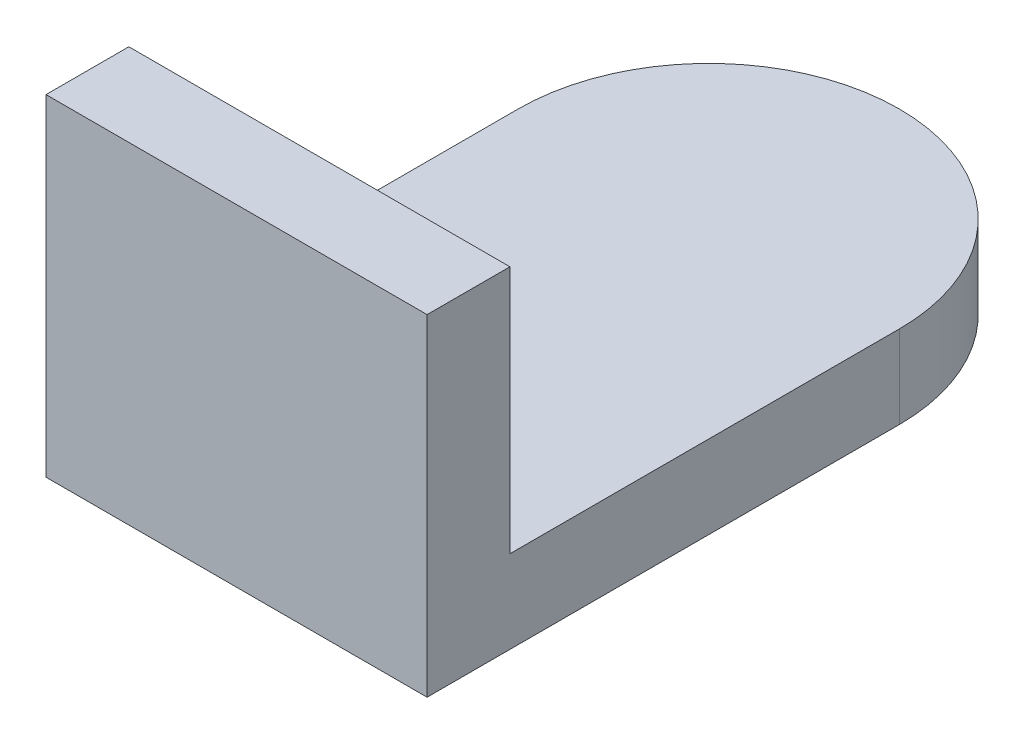
ISO-10303-21;
HEADER;
FILE_DESCRIPTION(('STEP AP214'),'2;1');
FILE_NAME('part.step','',(''),(''),'','','');
FILE_SCHEMA(('AUTOMOTIVE_DESIGN { 1 0 10303 214 1 1 1 1 }'));
ENDSEC;
DATA;
#1=APPLICATION_CONTEXT('core data for automotive mechanical design processes');
#2=APPLICATION_PROTOCOL_DEFINITION('international standard','automotive_design',2000,#1);
#3=PRODUCT_CONTEXT('',#1,'mechanical');
#4=PRODUCT('Part','Part','',(#3));
#5=PRODUCT_RELATED_PRODUCT_CATEGORY('part','',(#4));
#6=PRODUCT_DEFINITION_FORMATION('','',#4);
#7=PRODUCT_DEFINITION_CONTEXT('part definition',#1,'design');
#8=PRODUCT_DEFINITION('design','',#6,#7);
#9=PRODUCT_DEFINITION_SHAPE('','',#8);
#10=(LENGTH_UNIT() NAMED_UNIT(*) SI_UNIT(.MILLI.,.METRE.));
#11=(NAMED_UNIT(*) PLANE_ANGLE_UNIT() SI_UNIT($,.RADIAN.));
#12=(NAMED_UNIT(*) SI_UNIT($,.STERADIAN.) SOLID_ANGLE_UNIT());
#13=UNCERTAINTY_MEASURE_WITH_UNIT(LENGTH_MEASURE(1.E-05),#10,'distance_accuracy_value','');
#14=(GEOMETRIC_REPRESENTATION_CONTEXT(3) GLOBAL_UNCERTAINTY_ASSIGNED_CONTEXT((#13)) GLOBAL_UNIT_ASSIGNED_CONTEXT((#10,
#11,#12)) REPRESENTATION_CONTEXT('',''));
#15=CARTESIAN_POINT('',(0.,0.,0.));
#16=DIRECTION('',(0.,0.,1.));
#17=DIRECTION('',(1.,0.,0.));
#18=AXIS2_PLACEMENT_3D('',#15,#16,#17);
#19=CARTESIAN_POINT('',(0.,0.,1.45));
#20=DIRECTION('',(0.,0.,-1.));
#21=DIRECTION('',(-1.,0.,0.));
#22=AXIS2_PLACEMENT_3D('',#19,#20,#21);
#23=PLANE('',#22);
#24=DIRECTION('',(0.,1.,0.));
#25=VECTOR('',#24,1.);
#26=CARTESIAN_POINT('',(0.365,-0.2,1.45));
#27=LINE('',#26,#25);
#28=CARTESIAN_POINT('',(0.365,-0.35,1.45));
#29=VERTEX_POINT('',#28);
#30=CARTESIAN_POINT('',(0.365,-0.2,1.45));
#31=VERTEX_POINT('',#30);
#32=EDGE_CURVE('E11',#29,#31,#27,.T.);
#33=ORIENTED_EDGE('',*,*,#32,.F.);
#34=DIRECTION('',(-1.,0.,0.));
#35=VECTOR('',#34,1.);
#36=CARTESIAN_POINT('',(0.135,-0.35,1.45));
#37=LINE('',#36,#35);
#38=CARTESIAN_POINT('',(0.135,-0.35,1.45));
#39=VERTEX_POINT('',#38);
#40=EDGE_CURVE('E24',#29,#39,#37,.T.);
#41=ORIENTED_EDGE('',*,*,#40,.T.);
#42=DIRECTION('',(0.,-1.,0.));
#43=VECTOR('',#42,1.);
#44=CARTESIAN_POINT('',(0.135,-0.2,1.45));
#45=LINE('',#44,#43);
#46=CARTESIAN_POINT('',(0.135,-0.2,1.45));
#47=VERTEX_POINT('',#46);
#48=EDGE_CURVE('E74',#47,#39,#45,.T.);
#49=ORIENTED_EDGE('',*,*,#48,.F.);
#50=DIRECTION('',(-1.,0.,0.));
#51=VECTOR('',#50,1.);
#52=CARTESIAN_POINT('',(0.135,-0.2,1.45));
#53=LINE('',#52,#51);
#54=EDGE_CURVE('E117',#31,#47,#53,.T.);
#55=ORIENTED_EDGE('',*,*,#54,.F.);
#56=EDGE_LOOP('',(#33,#41,#49,#55));
#57=FACE_BOUND('',#56,.T.);
#58=ADVANCED_FACE('F17',(#57),#23,.T.);
#59=CARTESIAN_POINT('',(0.135,-0.2,1.45));
#60=DIRECTION('',(0.,1.,0.));
#61=DIRECTION('',(-1.,0.,0.));
#62=AXIS2_PLACEMENT_3D('',#59,#60,#61);
#63=PLANE('',#62);
#64=DIRECTION('',(-1.,0.,0.));
#65=VECTOR('',#64,1.);
#66=CARTESIAN_POINT('',(0.135,-0.2,1.5));
#67=LINE('',#66,#65);
#68=CARTESIAN_POINT('',(0.365,-0.2,1.5));
#69=VERTEX_POINT('',#68);
#70=CARTESIAN_POINT('',(0.135,-0.2,1.5));
#71=VERTEX_POINT('',#70);
#72=EDGE_CURVE('E115',#69,#71,#67,.T.);
#73=ORIENTED_EDGE('',*,*,#72,.F.);
#74=DIRECTION('',(0.,0.,1.));
#75=VECTOR('',#74,1.);
#76=CARTESIAN_POINT('',(0.365,-0.2,1.45));
#77=LINE('',#76,#75);
#78=EDGE_CURVE('E113',#31,#69,#77,.T.);
#79=ORIENTED_EDGE('',*,*,#78,.F.);
#80=ORIENTED_EDGE('',*,*,#54,.T.);
#81=DIRECTION('',(0.,0.,1.));
#82=VECTOR('',#81,1.);
#83=CARTESIAN_POINT('',(0.135,-0.2,1.45));
#84=LINE('',#83,#82);
#85=EDGE_CURVE('E110',#47,#71,#84,.T.);
#86=ORIENTED_EDGE('',*,*,#85,.T.);
#87=EDGE_LOOP('',(#73,#79,#80,#86));
#88=FACE_BOUND('',#87,.T.);
#89=ADVANCED_FACE('F127',(#88),#63,.T.);
#90=CARTESIAN_POINT('',(0.365,-0.2,1.45));
#91=DIRECTION('',(1.,0.,0.));
#92=DIRECTION('',(0.,0.,-1.));
#93=AXIS2_PLACEMENT_3D('',#90,#91,#92);
#94=PLANE('',#93);
#95=DIRECTION('',(0.,1.,0.));
#96=VECTOR('',#95,1.);
#97=CARTESIAN_POINT('',(0.365,-0.2,1.5));
#98=LINE('',#97,#96);
#99=CARTESIAN_POINT('',(0.365,-0.4,1.5));
#100=VERTEX_POINT('',#99);
#101=EDGE_CURVE('E107',#100,#69,#98,.T.);
#102=ORIENTED_EDGE('',*,*,#101,.F.);
#103=DIRECTION('',(0.,0.,1.));
#104=VECTOR('',#103,1.);
#105=CARTESIAN_POINT('',(0.365,-0.4,1.45));
#106=LINE('',#105,#104);
#107=CARTESIAN_POINT('',(0.365,-0.4,1.215));
#108=VERTEX_POINT('',#107);
#109=EDGE_CURVE('E104',#108,#100,#106,.T.);
#110=ORIENTED_EDGE('',*,*,#109,.F.);
#111=DIRECTION('',(0.,-1.,0.));
#112=VECTOR('',#111,1.);
#113=CARTESIAN_POINT('',(0.365,-0.35,1.215));
#114=LINE('',#113,#112);
#115=CARTESIAN_POINT('',(0.365,-0.35,1.215));
#116=VERTEX_POINT('',#115);
#117=EDGE_CURVE('E102',#116,#108,#114,.T.);
#118=ORIENTED_EDGE('',*,*,#117,.F.);
#119=DIRECTION('',(0.,0.,1.));
#120=VECTOR('',#119,1.);
#121=CARTESIAN_POINT('',(0.365,-0.35,1.45));
#122=LINE('',#121,#120);
#123=EDGE_CURVE('E90',#116,#29,#122,.T.);
#124=ORIENTED_EDGE('',*,*,#123,.T.);
#125=ORIENTED_EDGE('',*,*,#32,.T.);
#126=ORIENTED_EDGE('',*,*,#78,.T.);
#127=EDGE_LOOP('',(#102,#110,#118,#124,#125,#126));
#128=FACE_BOUND('',#127,.T.);
#129=ADVANCED_FACE('F120',(#128),#94,.T.);
#130=CARTESIAN_POINT('',(0.135,-0.4,1.45));
#131=DIRECTION('',(0.,-1.,0.));
#132=DIRECTION('',(1.,0.,0.));
#133=AXIS2_PLACEMENT_3D('',#130,#131,#132);
#134=PLANE('',#133);
#135=DIRECTION('',(1.,0.,0.));
#136=VECTOR('',#135,1.);
#137=CARTESIAN_POINT('',(0.135,-0.4,1.5));
#138=LINE('',#137,#136);
#139=CARTESIAN_POINT('',(0.135,-0.4,1.5));
#140=VERTEX_POINT('',#139);
#141=EDGE_CURVE('E98',#140,#100,#138,.T.);
#142=ORIENTED_EDGE('',*,*,#141,.F.);
#143=DIRECTION('',(0.,0.,1.));
#144=VECTOR('',#143,1.);
#145=CARTESIAN_POINT('',(0.135,-0.4,1.45));
#146=LINE('',#145,#144);
#147=CARTESIAN_POINT('',(0.135,-0.4,1.215));
#148=VERTEX_POINT('',#147);
#149=EDGE_CURVE('E96',#148,#140,#146,.T.);
#150=ORIENTED_EDGE('',*,*,#149,.F.);
#151=CARTESIAN_POINT('',(0.25,-0.4,1.215));
#152=DIRECTION('',(0.,-1.,0.));
#153=DIRECTION('',(1.,0.,0.));
#154=AXIS2_PLACEMENT_3D('',#151,#152,#153);
#155=CIRCLE('',#154,0.115);
#156=EDGE_CURVE('E86',#148,#108,#155,.T.);
#157=ORIENTED_EDGE('',*,*,#156,.T.);
#158=ORIENTED_EDGE('',*,*,#109,.T.);
#159=EDGE_LOOP('',(#142,#150,#157,#158));
#160=FACE_BOUND('',#159,.T.);
#161=ADVANCED_FACE('F122',(#160),#134,.T.);
#162=CARTESIAN_POINT('',(0.135,-0.2,1.45));
#163=DIRECTION('',(-1.,0.,0.));
#164=DIRECTION('',(0.,0.,1.));
#165=AXIS2_PLACEMENT_3D('',#162,#163,#164);
#166=PLANE('',#165);
#167=DIRECTION('',(0.,-1.,0.));
#168=VECTOR('',#167,1.);
#169=CARTESIAN_POINT('',(0.135,-0.2,1.5));
#170=LINE('',#169,#168);
#171=EDGE_CURVE('E77',#71,#140,#170,.T.);
#172=ORIENTED_EDGE('',*,*,#171,.F.);
#173=ORIENTED_EDGE('',*,*,#85,.F.);
#174=ORIENTED_EDGE('',*,*,#48,.T.);
#175=DIRECTION('',(0.,0.,-1.));
#176=VECTOR('',#175,1.);
#177=CARTESIAN_POINT('',(0.135,-0.35,1.45));
#178=LINE('',#177,#176);
#179=CARTESIAN_POINT('',(0.135,-0.35,1.215));
#180=VERTEX_POINT('',#179);
#181=EDGE_CURVE('E67',#39,#180,#178,.T.);
#182=ORIENTED_EDGE('',*,*,#181,.T.);
#183=DIRECTION('',(0.,-1.,0.));
#184=VECTOR('',#183,1.);
#185=CARTESIAN_POINT('',(0.135,-0.35,1.215));
#186=LINE('',#185,#184);
#187=EDGE_CURVE('E72',#180,#148,#186,.T.);
#188=ORIENTED_EDGE('',*,*,#187,.T.);
#189=ORIENTED_EDGE('',*,*,#149,.T.);
#190=EDGE_LOOP('',(#172,#173,#174,#182,#188,#189));
#191=FACE_BOUND('',#190,.T.);
#192=ADVANCED_FACE('F70',(#191),#166,.T.);
#193=CARTESIAN_POINT('',(0.,0.,1.5));
#194=DIRECTION('',(0.,0.,-1.));
#195=DIRECTION('',(-1.,0.,0.));
#196=AXIS2_PLACEMENT_3D('',#193,#194,#195);
#197=PLANE('',#196);
#198=ORIENTED_EDGE('',*,*,#72,.T.);
#199=ORIENTED_EDGE('',*,*,#171,.T.);
#200=ORIENTED_EDGE('',*,*,#141,.T.);
#201=ORIENTED_EDGE('',*,*,#101,.T.);
#202=EDGE_LOOP('',(#198,#199,#200,#201));
#203=FACE_BOUND('',#202,.T.);
#204=ADVANCED_FACE('F124',(#203),#197,.F.);
#205=CARTESIAN_POINT('',(0.25,-0.35,1.215));
#206=DIRECTION('',(0.,-1.,0.));
#207=DIRECTION('',(1.,0.,0.));
#208=AXIS2_PLACEMENT_3D('',#205,#206,#207);
#209=CYLINDRICAL_SURFACE('',#208,0.115);
#210=ORIENTED_EDGE('',*,*,#156,.F.);
#211=ORIENTED_EDGE('',*,*,#187,.F.);
#212=CARTESIAN_POINT('',(0.25,-0.35,1.215));
#213=DIRECTION('',(0.,-1.,0.));
#214=DIRECTION('',(1.,0.,0.));
#215=AXIS2_PLACEMENT_3D('',#212,#213,#214);
#216=CIRCLE('',#215,0.115);
#217=EDGE_CURVE('E84',#180,#116,#216,.T.);
#218=ORIENTED_EDGE('',*,*,#217,.T.);
#219=ORIENTED_EDGE('',*,*,#117,.T.);
#220=EDGE_LOOP('',(#210,#211,#218,#219));
#221=FACE_BOUND('',#220,.T.);
#222=ADVANCED_FACE('F82',(#221),#209,.T.);
#223=CARTESIAN_POINT('',(0.25,-0.35,1.215));
#224=DIRECTION('',(0.,-1.,0.));
#225=DIRECTION('',(1.,0.,0.));
#226=AXIS2_PLACEMENT_3D('',#223,#224,#225);
#227=PLANE('',#226);
#228=ORIENTED_EDGE('',*,*,#181,.F.);
#229=ORIENTED_EDGE('',*,*,#40,.F.);
#230=ORIENTED_EDGE('',*,*,#123,.F.);
#231=ORIENTED_EDGE('',*,*,#217,.F.);
#232=EDGE_LOOP('',(#228,#229,#230,#231));
#233=FACE_BOUND('',#232,.T.);
#234=ADVANCED_FACE('F89',(#233),#227,.F.);
#235=CLOSED_SHELL('',(#58,#89,#129,#161,#192,#204,#222,#234));
#236=MANIFOLD_SOLID_BREP('B1',#235);
#237=ADVANCED_BREP_SHAPE_REPRESENTATION('',(#18,#236),#14);
#238=SHAPE_DEFINITION_REPRESENTATION(#9,#237);
ENDSEC;
END-ISO-10303-21;
